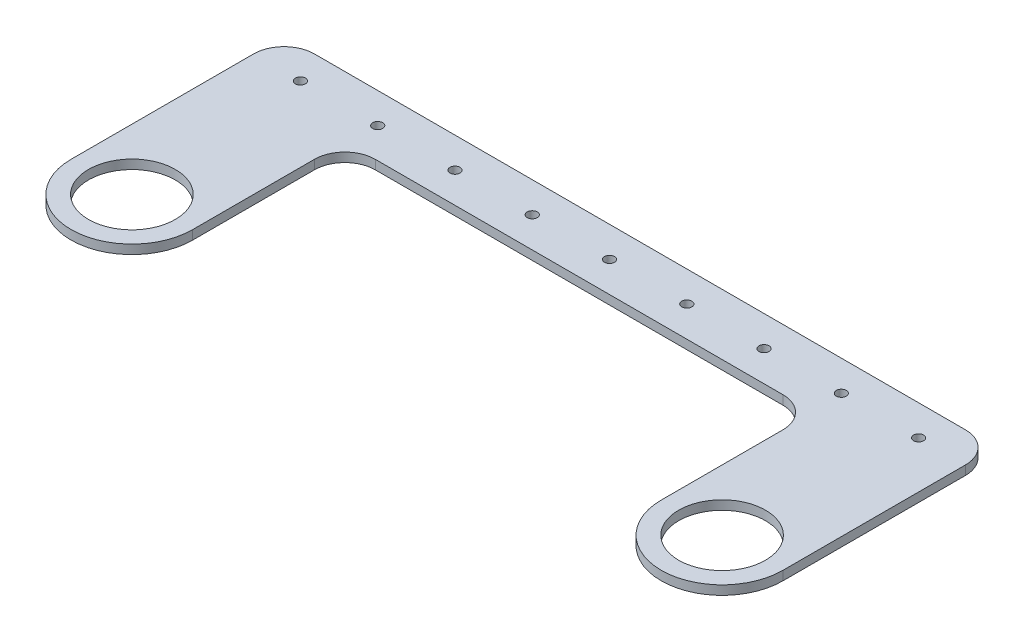
ISO-10303-21;
HEADER;
FILE_DESCRIPTION(('STEP AP214'),'2;1');
FILE_NAME('part.step','',(''),(''),'','','');
FILE_SCHEMA(('AUTOMOTIVE_DESIGN { 1 0 10303 214 1 1 1 1 }'));
ENDSEC;
DATA;
#1=APPLICATION_CONTEXT('core data for automotive mechanical design processes');
#2=APPLICATION_PROTOCOL_DEFINITION('international standard','automotive_design',2000,#1);
#3=PRODUCT_CONTEXT('',#1,'mechanical');
#4=PRODUCT('Part','Part','',(#3));
#5=PRODUCT_RELATED_PRODUCT_CATEGORY('part','',(#4));
#6=PRODUCT_DEFINITION_FORMATION('','',#4);
#7=PRODUCT_DEFINITION_CONTEXT('part definition',#1,'design');
#8=PRODUCT_DEFINITION('design','',#6,#7);
#9=PRODUCT_DEFINITION_SHAPE('','',#8);
#10=(LENGTH_UNIT() NAMED_UNIT(*) SI_UNIT(.MILLI.,.METRE.));
#11=(NAMED_UNIT(*) PLANE_ANGLE_UNIT() SI_UNIT($,.RADIAN.));
#12=(NAMED_UNIT(*) SI_UNIT($,.STERADIAN.) SOLID_ANGLE_UNIT());
#13=UNCERTAINTY_MEASURE_WITH_UNIT(LENGTH_MEASURE(1.E-05),#10,'distance_accuracy_value','');
#14=(GEOMETRIC_REPRESENTATION_CONTEXT(3) GLOBAL_UNCERTAINTY_ASSIGNED_CONTEXT((#13)) GLOBAL_UNIT_ASSIGNED_CONTEXT((#10,
#11,#12)) REPRESENTATION_CONTEXT('',''));
#15=CARTESIAN_POINT('',(0.,0.,0.));
#16=DIRECTION('',(0.,0.,1.));
#17=DIRECTION('',(1.,0.,0.));
#18=AXIS2_PLACEMENT_3D('',#15,#16,#17);
#19=CARTESIAN_POINT('',(0.,3.,10.));
#20=DIRECTION('',(0.,0.,-1.));
#21=DIRECTION('',(-1.,0.,0.));
#22=AXIS2_PLACEMENT_3D('',#19,#20,#21);
#23=PLANE('',#22);
#24=DIRECTION('',(1.,0.,0.));
#25=VECTOR('',#24,1.);
#26=CARTESIAN_POINT('',(0.,0.,10.));
#27=LINE('',#26,#25);
#28=CARTESIAN_POINT('',(-67.,0.,10.));
#29=VERTEX_POINT('',#28);
#30=CARTESIAN_POINT('',(67.,0.,10.));
#31=VERTEX_POINT('',#30);
#32=EDGE_CURVE('E208',#29,#31,#27,.T.);
#33=ORIENTED_EDGE('',*,*,#32,.T.);
#34=DIRECTION('',(0.,-1.,0.));
#35=VECTOR('',#34,1.);
#36=CARTESIAN_POINT('',(67.,3.,10.));
#37=LINE('',#36,#35);
#38=CARTESIAN_POINT('',(67.,3.,10.));
#39=VERTEX_POINT('',#38);
#40=EDGE_CURVE('E269',#31,#39,#37,.F.);
#41=ORIENTED_EDGE('',*,*,#40,.T.);
#42=DIRECTION('',(1.,0.,0.));
#43=VECTOR('',#42,1.);
#44=CARTESIAN_POINT('',(0.,3.,10.));
#45=LINE('',#44,#43);
#46=CARTESIAN_POINT('',(-67.,3.,10.));
#47=VERTEX_POINT('',#46);
#48=EDGE_CURVE('E145',#47,#39,#45,.T.);
#49=ORIENTED_EDGE('',*,*,#48,.F.);
#50=DIRECTION('',(0.,-1.,0.));
#51=VECTOR('',#50,1.);
#52=CARTESIAN_POINT('',(-67.,3.,10.));
#53=LINE('',#52,#51);
#54=EDGE_CURVE('E266',#47,#29,#53,.T.);
#55=ORIENTED_EDGE('',*,*,#54,.T.);
#56=EDGE_LOOP('',(#33,#41,#49,#55));
#57=FACE_BOUND('',#56,.T.);
#58=ADVANCED_FACE('F43',(#57),#23,.F.);
#59=CARTESIAN_POINT('',(77.,3.,0.));
#60=DIRECTION('',(1.,0.,0.));
#61=DIRECTION('',(0.,0.,-1.));
#62=AXIS2_PLACEMENT_3D('',#59,#60,#61);
#63=PLANE('',#62);
#64=DIRECTION('',(0.,0.,1.));
#65=VECTOR('',#64,1.);
#66=CARTESIAN_POINT('',(77.,3.,0.));
#67=LINE('',#66,#65);
#68=CARTESIAN_POINT('',(77.,3.,20.));
#69=VERTEX_POINT('',#68);
#70=CARTESIAN_POINT('',(77.,3.,60.));
#71=VERTEX_POINT('',#70);
#72=EDGE_CURVE('E133',#69,#71,#67,.T.);
#73=ORIENTED_EDGE('',*,*,#72,.F.);
#74=DIRECTION('',(0.,-1.,0.));
#75=VECTOR('',#74,1.);
#76=CARTESIAN_POINT('',(77.,0.,20.));
#77=LINE('',#76,#75);
#78=CARTESIAN_POINT('',(77.,0.,20.));
#79=VERTEX_POINT('',#78);
#80=EDGE_CURVE('E155',#69,#79,#77,.T.);
#81=ORIENTED_EDGE('',*,*,#80,.T.);
#82=DIRECTION('',(0.,0.,1.));
#83=VECTOR('',#82,1.);
#84=CARTESIAN_POINT('',(77.,0.,0.));
#85=LINE('',#84,#83);
#86=CARTESIAN_POINT('',(77.,0.,60.));
#87=VERTEX_POINT('',#86);
#88=EDGE_CURVE('E151',#79,#87,#85,.T.);
#89=ORIENTED_EDGE('',*,*,#88,.T.);
#90=DIRECTION('',(0.,-1.,0.));
#91=VECTOR('',#90,1.);
#92=CARTESIAN_POINT('',(77.,3.,60.));
#93=LINE('',#92,#91);
#94=EDGE_CURVE('E148',#71,#87,#93,.T.);
#95=ORIENTED_EDGE('',*,*,#94,.F.);
#96=EDGE_LOOP('',(#73,#81,#89,#95));
#97=FACE_BOUND('',#96,.T.);
#98=ADVANCED_FACE('F149',(#97),#63,.F.);
#99=CARTESIAN_POINT('',(97.,3.,60.));
#100=DIRECTION('',(0.,-1.,0.));
#101=DIRECTION('',(0.,0.,-1.));
#102=AXIS2_PLACEMENT_3D('',#99,#100,#101);
#103=CYLINDRICAL_SURFACE('',#102,20.);
#104=CARTESIAN_POINT('',(97.,0.,60.));
#105=DIRECTION('',(0.,1.,0.));
#106=DIRECTION('',(0.,0.,1.));
#107=AXIS2_PLACEMENT_3D('',#104,#105,#106);
#108=CIRCLE('',#107,20.);
#109=CARTESIAN_POINT('',(117.,0.,60.));
#110=VERTEX_POINT('',#109);
#111=EDGE_CURVE('E212',#110,#87,#108,.F.);
#112=ORIENTED_EDGE('',*,*,#111,.F.);
#113=DIRECTION('',(0.,-1.,0.));
#114=VECTOR('',#113,1.);
#115=CARTESIAN_POINT('',(117.,3.,60.));
#116=LINE('',#115,#114);
#117=CARTESIAN_POINT('',(117.,3.,60.));
#118=VERTEX_POINT('',#117);
#119=EDGE_CURVE('E156',#118,#110,#116,.T.);
#120=ORIENTED_EDGE('',*,*,#119,.F.);
#121=CARTESIAN_POINT('',(97.,3.,60.));
#122=DIRECTION('',(0.,1.,0.));
#123=DIRECTION('',(0.,0.,1.));
#124=AXIS2_PLACEMENT_3D('',#121,#122,#123);
#125=CIRCLE('',#124,20.);
#126=EDGE_CURVE('E138',#118,#71,#125,.F.);
#127=ORIENTED_EDGE('',*,*,#126,.T.);
#128=ORIENTED_EDGE('',*,*,#94,.T.);
#129=EDGE_LOOP('',(#112,#120,#127,#128));
#130=FACE_BOUND('',#129,.T.);
#131=ADVANCED_FACE('F158',(#130),#103,.T.);
#132=CARTESIAN_POINT('',(117.,3.,0.));
#133=DIRECTION('',(-1.,0.,0.));
#134=DIRECTION('',(0.,0.,1.));
#135=AXIS2_PLACEMENT_3D('',#132,#133,#134);
#136=PLANE('',#135);
#137=DIRECTION('',(0.,0.,-1.));
#138=VECTOR('',#137,1.);
#139=CARTESIAN_POINT('',(117.,0.,0.));
#140=LINE('',#139,#138);
#141=CARTESIAN_POINT('',(117.,0.,0.));
#142=VERTEX_POINT('',#141);
#143=EDGE_CURVE('E214',#110,#142,#140,.T.);
#144=ORIENTED_EDGE('',*,*,#143,.T.);
#145=DIRECTION('',(0.,-1.,0.));
#146=VECTOR('',#145,1.);
#147=CARTESIAN_POINT('',(117.,3.,0.));
#148=LINE('',#147,#146);
#149=CARTESIAN_POINT('',(117.,3.,0.));
#150=VERTEX_POINT('',#149);
#151=EDGE_CURVE('E66',#142,#150,#148,.F.);
#152=ORIENTED_EDGE('',*,*,#151,.T.);
#153=DIRECTION('',(0.,0.,-1.));
#154=VECTOR('',#153,1.);
#155=CARTESIAN_POINT('',(117.,3.,0.));
#156=LINE('',#155,#154);
#157=EDGE_CURVE('E159',#118,#150,#156,.T.);
#158=ORIENTED_EDGE('',*,*,#157,.F.);
#159=ORIENTED_EDGE('',*,*,#119,.T.);
#160=EDGE_LOOP('',(#144,#152,#158,#159));
#161=FACE_BOUND('',#160,.T.);
#162=ADVANCED_FACE('F312',(#161),#136,.F.);
#163=CARTESIAN_POINT('',(0.,3.,-10.));
#164=DIRECTION('',(0.,0.,-1.));
#165=DIRECTION('',(-1.,0.,0.));
#166=AXIS2_PLACEMENT_3D('',#163,#164,#165);
#167=PLANE('',#166);
#168=DIRECTION('',(1.,0.,0.));
#169=VECTOR('',#168,1.);
#170=CARTESIAN_POINT('',(0.,3.,-10.));
#171=LINE('',#170,#169);
#172=CARTESIAN_POINT('',(-107.,3.,-10.));
#173=VERTEX_POINT('',#172);
#174=CARTESIAN_POINT('',(107.,3.,-10.));
#175=VERTEX_POINT('',#174);
#176=EDGE_CURVE('E161',#173,#175,#171,.T.);
#177=ORIENTED_EDGE('',*,*,#176,.T.);
#178=DIRECTION('',(0.,-1.,0.));
#179=VECTOR('',#178,1.);
#180=CARTESIAN_POINT('',(107.,0.,-10.));
#181=LINE('',#180,#179);
#182=CARTESIAN_POINT('',(107.,0.,-10.));
#183=VERTEX_POINT('',#182);
#184=EDGE_CURVE('E275',#175,#183,#181,.T.);
#185=ORIENTED_EDGE('',*,*,#184,.T.);
#186=DIRECTION('',(1.,0.,0.));
#187=VECTOR('',#186,1.);
#188=CARTESIAN_POINT('',(0.,0.,-10.));
#189=LINE('',#188,#187);
#190=CARTESIAN_POINT('',(-107.,0.,-10.));
#191=VERTEX_POINT('',#190);
#192=EDGE_CURVE('E216',#191,#183,#189,.T.);
#193=ORIENTED_EDGE('',*,*,#192,.F.);
#194=DIRECTION('',(0.,-1.,0.));
#195=VECTOR('',#194,1.);
#196=CARTESIAN_POINT('',(-107.,3.,-10.));
#197=LINE('',#196,#195);
#198=EDGE_CURVE('E273',#191,#173,#197,.F.);
#199=ORIENTED_EDGE('',*,*,#198,.T.);
#200=EDGE_LOOP('',(#177,#185,#193,#199));
#201=FACE_BOUND('',#200,.T.);
#202=ADVANCED_FACE('F318',(#201),#167,.T.);
#203=CARTESIAN_POINT('',(-117.,3.,0.));
#204=DIRECTION('',(1.,0.,0.));
#205=DIRECTION('',(0.,0.,-1.));
#206=AXIS2_PLACEMENT_3D('',#203,#204,#205);
#207=PLANE('',#206);
#208=DIRECTION('',(0.,0.,1.));
#209=VECTOR('',#208,1.);
#210=CARTESIAN_POINT('',(-117.,3.,0.));
#211=LINE('',#210,#209);
#212=CARTESIAN_POINT('',(-117.,3.,0.));
#213=VERTEX_POINT('',#212);
#214=CARTESIAN_POINT('',(-117.,3.,60.));
#215=VERTEX_POINT('',#214);
#216=EDGE_CURVE('E167',#213,#215,#211,.T.);
#217=ORIENTED_EDGE('',*,*,#216,.F.);
#218=DIRECTION('',(0.,-1.,0.));
#219=VECTOR('',#218,1.);
#220=CARTESIAN_POINT('',(-117.,0.,0.));
#221=LINE('',#220,#219);
#222=CARTESIAN_POINT('',(-117.,0.,0.));
#223=VERTEX_POINT('',#222);
#224=EDGE_CURVE('E286',#213,#223,#221,.T.);
#225=ORIENTED_EDGE('',*,*,#224,.T.);
#226=DIRECTION('',(0.,0.,1.));
#227=VECTOR('',#226,1.);
#228=CARTESIAN_POINT('',(-117.,0.,0.));
#229=LINE('',#228,#227);
#230=CARTESIAN_POINT('',(-117.,0.,60.));
#231=VERTEX_POINT('',#230);
#232=EDGE_CURVE('E219',#223,#231,#229,.T.);
#233=ORIENTED_EDGE('',*,*,#232,.T.);
#234=DIRECTION('',(0.,-1.,0.));
#235=VECTOR('',#234,1.);
#236=CARTESIAN_POINT('',(-117.,3.,60.));
#237=LINE('',#236,#235);
#238=EDGE_CURVE('E261',#215,#231,#237,.T.);
#239=ORIENTED_EDGE('',*,*,#238,.F.);
#240=EDGE_LOOP('',(#217,#225,#233,#239));
#241=FACE_BOUND('',#240,.T.);
#242=ADVANCED_FACE('F325',(#241),#207,.F.);
#243=CARTESIAN_POINT('',(-97.,3.,60.));
#244=DIRECTION('',(0.,-1.,0.));
#245=DIRECTION('',(0.,0.,-1.));
#246=AXIS2_PLACEMENT_3D('',#243,#244,#245);
#247=CYLINDRICAL_SURFACE('',#246,20.);
#248=CARTESIAN_POINT('',(-97.,0.,60.));
#249=DIRECTION('',(0.,1.,0.));
#250=DIRECTION('',(0.,0.,1.));
#251=AXIS2_PLACEMENT_3D('',#248,#249,#250);
#252=CIRCLE('',#251,20.);
#253=CARTESIAN_POINT('',(-77.,0.,60.));
#254=VERTEX_POINT('',#253);
#255=EDGE_CURVE('E221',#231,#254,#252,.T.);
#256=ORIENTED_EDGE('',*,*,#255,.T.);
#257=DIRECTION('',(0.,-1.,0.));
#258=VECTOR('',#257,1.);
#259=CARTESIAN_POINT('',(-77.,3.,60.));
#260=LINE('',#259,#258);
#261=CARTESIAN_POINT('',(-77.,3.,60.));
#262=VERTEX_POINT('',#261);
#263=EDGE_CURVE('E207',#262,#254,#260,.T.);
#264=ORIENTED_EDGE('',*,*,#263,.F.);
#265=CARTESIAN_POINT('',(-97.,3.,60.));
#266=DIRECTION('',(0.,1.,0.));
#267=DIRECTION('',(0.,0.,1.));
#268=AXIS2_PLACEMENT_3D('',#265,#266,#267);
#269=CIRCLE('',#268,20.);
#270=EDGE_CURVE('E169',#215,#262,#269,.T.);
#271=ORIENTED_EDGE('',*,*,#270,.F.);
#272=ORIENTED_EDGE('',*,*,#238,.T.);
#273=EDGE_LOOP('',(#256,#264,#271,#272));
#274=FACE_BOUND('',#273,.T.);
#275=ADVANCED_FACE('F328',(#274),#247,.T.);
#276=CARTESIAN_POINT('',(101.6,3.,0.));
#277=DIRECTION('',(0.,-1.,0.));
#278=DIRECTION('',(0.,0.,-1.));
#279=AXIS2_PLACEMENT_3D('',#276,#277,#278);
#280=CYLINDRICAL_SURFACE('',#279,1.65);
#281=CARTESIAN_POINT('',(101.6,3.,0.));
#282=DIRECTION('',(0.,1.,0.));
#283=DIRECTION('',(0.,0.,1.));
#284=AXIS2_PLACEMENT_3D('',#281,#282,#283);
#285=CIRCLE('',#284,1.65);
#286=CARTESIAN_POINT('',(101.6,3.,1.65));
#287=VERTEX_POINT('',#286);
#288=EDGE_CURVE('E201',#287,#287,#285,.T.);
#289=ORIENTED_EDGE('',*,*,#288,.T.);
#290=EDGE_LOOP('',(#289));
#291=FACE_BOUND('',#290,.T.);
#292=CARTESIAN_POINT('',(101.6,0.,0.));
#293=DIRECTION('',(0.,1.,0.));
#294=DIRECTION('',(0.,0.,1.));
#295=AXIS2_PLACEMENT_3D('',#292,#293,#294);
#296=CIRCLE('',#295,1.65);
#297=CARTESIAN_POINT('',(101.6,0.,1.65));
#298=VERTEX_POINT('',#297);
#299=EDGE_CURVE('E253',#298,#298,#296,.T.);
#300=ORIENTED_EDGE('',*,*,#299,.F.);
#301=EDGE_LOOP('',(#300));
#302=FACE_BOUND('',#301,.T.);
#303=ADVANCED_FACE('F331',(#291,#302),#280,.F.);
#304=CARTESIAN_POINT('',(0.,3.,0.));
#305=DIRECTION('',(0.,-1.,0.));
#306=DIRECTION('',(0.,0.,-1.));
#307=AXIS2_PLACEMENT_3D('',#304,#305,#306);
#308=CYLINDRICAL_SURFACE('',#307,1.65);
#309=CARTESIAN_POINT('',(0.,3.,0.));
#310=DIRECTION('',(0.,1.,0.));
#311=DIRECTION('',(0.,0.,1.));
#312=AXIS2_PLACEMENT_3D('',#309,#310,#311);
#313=CIRCLE('',#312,1.65);
#314=CARTESIAN_POINT('',(0.,3.,1.65));
#315=VERTEX_POINT('',#314);
#316=EDGE_CURVE('E198',#315,#315,#313,.T.);
#317=ORIENTED_EDGE('',*,*,#316,.T.);
#318=EDGE_LOOP('',(#317));
#319=FACE_BOUND('',#318,.T.);
#320=CARTESIAN_POINT('',(0.,0.,0.));
#321=DIRECTION('',(0.,1.,0.));
#322=DIRECTION('',(0.,0.,1.));
#323=AXIS2_PLACEMENT_3D('',#320,#321,#322);
#324=CIRCLE('',#323,1.65);
#325=CARTESIAN_POINT('',(0.,0.,1.65));
#326=VERTEX_POINT('',#325);
#327=EDGE_CURVE('E250',#326,#326,#324,.T.);
#328=ORIENTED_EDGE('',*,*,#327,.F.);
#329=EDGE_LOOP('',(#328));
#330=FACE_BOUND('',#329,.T.);
#331=ADVANCED_FACE('F337',(#319,#330),#308,.F.);
#332=CARTESIAN_POINT('',(25.4,3.,0.));
#333=DIRECTION('',(0.,-1.,0.));
#334=DIRECTION('',(0.,0.,-1.));
#335=AXIS2_PLACEMENT_3D('',#332,#333,#334);
#336=CYLINDRICAL_SURFACE('',#335,1.65);
#337=CARTESIAN_POINT('',(25.4,3.,0.));
#338=DIRECTION('',(0.,1.,0.));
#339=DIRECTION('',(0.,0.,1.));
#340=AXIS2_PLACEMENT_3D('',#337,#338,#339);
#341=CIRCLE('',#340,1.65);
#342=CARTESIAN_POINT('',(25.4,3.,1.65));
#343=VERTEX_POINT('',#342);
#344=EDGE_CURVE('E195',#343,#343,#341,.T.);
#345=ORIENTED_EDGE('',*,*,#344,.T.);
#346=EDGE_LOOP('',(#345));
#347=FACE_BOUND('',#346,.T.);
#348=CARTESIAN_POINT('',(25.4,0.,0.));
#349=DIRECTION('',(0.,1.,0.));
#350=DIRECTION('',(0.,0.,1.));
#351=AXIS2_PLACEMENT_3D('',#348,#349,#350);
#352=CIRCLE('',#351,1.65);
#353=CARTESIAN_POINT('',(25.4,0.,1.65));
#354=VERTEX_POINT('',#353);
#355=EDGE_CURVE('E247',#354,#354,#352,.T.);
#356=ORIENTED_EDGE('',*,*,#355,.F.);
#357=EDGE_LOOP('',(#356));
#358=FACE_BOUND('',#357,.T.);
#359=ADVANCED_FACE('F470',(#347,#358),#336,.F.);
#360=CARTESIAN_POINT('',(50.8,3.,0.));
#361=DIRECTION('',(0.,-1.,0.));
#362=DIRECTION('',(0.,0.,-1.));
#363=AXIS2_PLACEMENT_3D('',#360,#361,#362);
#364=CYLINDRICAL_SURFACE('',#363,1.65);
#365=CARTESIAN_POINT('',(50.8,3.,0.));
#366=DIRECTION('',(0.,1.,0.));
#367=DIRECTION('',(0.,0.,1.));
#368=AXIS2_PLACEMENT_3D('',#365,#366,#367);
#369=CIRCLE('',#368,1.65);
#370=CARTESIAN_POINT('',(50.8,3.,1.65));
#371=VERTEX_POINT('',#370);
#372=EDGE_CURVE('E192',#371,#371,#369,.T.);
#373=ORIENTED_EDGE('',*,*,#372,.T.);
#374=EDGE_LOOP('',(#373));
#375=FACE_BOUND('',#374,.T.);
#376=CARTESIAN_POINT('',(50.8,0.,0.));
#377=DIRECTION('',(0.,1.,0.));
#378=DIRECTION('',(0.,0.,1.));
#379=AXIS2_PLACEMENT_3D('',#376,#377,#378);
#380=CIRCLE('',#379,1.65);
#381=CARTESIAN_POINT('',(50.8,0.,1.65));
#382=VERTEX_POINT('',#381);
#383=EDGE_CURVE('E244',#382,#382,#380,.T.);
#384=ORIENTED_EDGE('',*,*,#383,.F.);
#385=EDGE_LOOP('',(#384));
#386=FACE_BOUND('',#385,.T.);
#387=ADVANCED_FACE('F479',(#375,#386),#364,.F.);
#388=CARTESIAN_POINT('',(-25.4,3.,0.));
#389=DIRECTION('',(0.,-1.,0.));
#390=DIRECTION('',(0.,0.,-1.));
#391=AXIS2_PLACEMENT_3D('',#388,#389,#390);
#392=CYLINDRICAL_SURFACE('',#391,1.65);
#393=CARTESIAN_POINT('',(-25.4,3.,0.));
#394=DIRECTION('',(0.,1.,0.));
#395=DIRECTION('',(0.,0.,1.));
#396=AXIS2_PLACEMENT_3D('',#393,#394,#395);
#397=CIRCLE('',#396,1.65);
#398=CARTESIAN_POINT('',(-25.4,3.,1.65));
#399=VERTEX_POINT('',#398);
#400=EDGE_CURVE('E189',#399,#399,#397,.T.);
#401=ORIENTED_EDGE('',*,*,#400,.T.);
#402=EDGE_LOOP('',(#401));
#403=FACE_BOUND('',#402,.T.);
#404=CARTESIAN_POINT('',(-25.4,0.,0.));
#405=DIRECTION('',(0.,1.,0.));
#406=DIRECTION('',(0.,0.,1.));
#407=AXIS2_PLACEMENT_3D('',#404,#405,#406);
#408=CIRCLE('',#407,1.65);
#409=CARTESIAN_POINT('',(-25.4,0.,1.65));
#410=VERTEX_POINT('',#409);
#411=EDGE_CURVE('E241',#410,#410,#408,.T.);
#412=ORIENTED_EDGE('',*,*,#411,.F.);
#413=EDGE_LOOP('',(#412));
#414=FACE_BOUND('',#413,.T.);
#415=ADVANCED_FACE('F488',(#403,#414),#392,.F.);
#416=CARTESIAN_POINT('',(-50.8,3.,0.));
#417=DIRECTION('',(0.,-1.,0.));
#418=DIRECTION('',(0.,0.,-1.));
#419=AXIS2_PLACEMENT_3D('',#416,#417,#418);
#420=CYLINDRICAL_SURFACE('',#419,1.65);
#421=CARTESIAN_POINT('',(-50.8,3.,0.));
#422=DIRECTION('',(0.,1.,0.));
#423=DIRECTION('',(0.,0.,1.));
#424=AXIS2_PLACEMENT_3D('',#421,#422,#423);
#425=CIRCLE('',#424,1.65);
#426=CARTESIAN_POINT('',(-50.8,3.,1.65));
#427=VERTEX_POINT('',#426);
#428=EDGE_CURVE('E186',#427,#427,#425,.T.);
#429=ORIENTED_EDGE('',*,*,#428,.T.);
#430=EDGE_LOOP('',(#429));
#431=FACE_BOUND('',#430,.T.);
#432=CARTESIAN_POINT('',(-50.8,0.,0.));
#433=DIRECTION('',(0.,1.,0.));
#434=DIRECTION('',(0.,0.,1.));
#435=AXIS2_PLACEMENT_3D('',#432,#433,#434);
#436=CIRCLE('',#435,1.65);
#437=CARTESIAN_POINT('',(-50.8,0.,1.65));
#438=VERTEX_POINT('',#437);
#439=EDGE_CURVE('E238',#438,#438,#436,.T.);
#440=ORIENTED_EDGE('',*,*,#439,.F.);
#441=EDGE_LOOP('',(#440));
#442=FACE_BOUND('',#441,.T.);
#443=ADVANCED_FACE('F497',(#431,#442),#420,.F.);
#444=CARTESIAN_POINT('',(-97.,3.,60.));
#445=DIRECTION('',(0.,-1.,0.));
#446=DIRECTION('',(0.,0.,-1.));
#447=AXIS2_PLACEMENT_3D('',#444,#445,#446);
#448=CYLINDRICAL_SURFACE('',#447,14.26);
#449=CARTESIAN_POINT('',(-97.,3.,60.));
#450=DIRECTION('',(0.,1.,0.));
#451=DIRECTION('',(0.,0.,1.));
#452=AXIS2_PLACEMENT_3D('',#449,#450,#451);
#453=CIRCLE('',#452,14.26);
#454=CARTESIAN_POINT('',(-97.,3.,74.26));
#455=VERTEX_POINT('',#454);
#456=EDGE_CURVE('E183',#455,#455,#453,.T.);
#457=ORIENTED_EDGE('',*,*,#456,.T.);
#458=EDGE_LOOP('',(#457));
#459=FACE_BOUND('',#458,.T.);
#460=CARTESIAN_POINT('',(-97.,0.,60.));
#461=DIRECTION('',(0.,1.,0.));
#462=DIRECTION('',(0.,0.,1.));
#463=AXIS2_PLACEMENT_3D('',#460,#461,#462);
#464=CIRCLE('',#463,14.26);
#465=CARTESIAN_POINT('',(-97.,0.,74.26));
#466=VERTEX_POINT('',#465);
#467=EDGE_CURVE('E235',#466,#466,#464,.T.);
#468=ORIENTED_EDGE('',*,*,#467,.F.);
#469=EDGE_LOOP('',(#468));
#470=FACE_BOUND('',#469,.T.);
#471=ADVANCED_FACE('F506',(#459,#470),#448,.F.);
#472=CARTESIAN_POINT('',(-101.6,3.,0.));
#473=DIRECTION('',(0.,-1.,0.));
#474=DIRECTION('',(0.,0.,-1.));
#475=AXIS2_PLACEMENT_3D('',#472,#473,#474);
#476=CYLINDRICAL_SURFACE('',#475,1.65);
#477=CARTESIAN_POINT('',(-101.6,3.,0.));
#478=DIRECTION('',(0.,1.,0.));
#479=DIRECTION('',(0.,0.,1.));
#480=AXIS2_PLACEMENT_3D('',#477,#478,#479);
#481=CIRCLE('',#480,1.65);
#482=CARTESIAN_POINT('',(-101.6,3.,1.65));
#483=VERTEX_POINT('',#482);
#484=EDGE_CURVE('E180',#483,#483,#481,.T.);
#485=ORIENTED_EDGE('',*,*,#484,.T.);
#486=EDGE_LOOP('',(#485));
#487=FACE_BOUND('',#486,.T.);
#488=CARTESIAN_POINT('',(-101.6,0.,0.));
#489=DIRECTION('',(0.,1.,0.));
#490=DIRECTION('',(0.,0.,1.));
#491=AXIS2_PLACEMENT_3D('',#488,#489,#490);
#492=CIRCLE('',#491,1.65);
#493=CARTESIAN_POINT('',(-101.6,0.,1.65));
#494=VERTEX_POINT('',#493);
#495=EDGE_CURVE('E232',#494,#494,#492,.T.);
#496=ORIENTED_EDGE('',*,*,#495,.F.);
#497=EDGE_LOOP('',(#496));
#498=FACE_BOUND('',#497,.T.);
#499=ADVANCED_FACE('F515',(#487,#498),#476,.F.);
#500=CARTESIAN_POINT('',(76.2,3.,0.));
#501=DIRECTION('',(0.,-1.,0.));
#502=DIRECTION('',(0.,0.,-1.));
#503=AXIS2_PLACEMENT_3D('',#500,#501,#502);
#504=CYLINDRICAL_SURFACE('',#503,1.65);
#505=CARTESIAN_POINT('',(76.2,3.,0.));
#506=DIRECTION('',(0.,1.,0.));
#507=DIRECTION('',(0.,0.,1.));
#508=AXIS2_PLACEMENT_3D('',#505,#506,#507);
#509=CIRCLE('',#508,1.65);
#510=CARTESIAN_POINT('',(76.2,3.,1.65));
#511=VERTEX_POINT('',#510);
#512=EDGE_CURVE('E177',#511,#511,#509,.T.);
#513=ORIENTED_EDGE('',*,*,#512,.T.);
#514=EDGE_LOOP('',(#513));
#515=FACE_BOUND('',#514,.T.);
#516=CARTESIAN_POINT('',(76.2,0.,0.));
#517=DIRECTION('',(0.,1.,0.));
#518=DIRECTION('',(0.,0.,1.));
#519=AXIS2_PLACEMENT_3D('',#516,#517,#518);
#520=CIRCLE('',#519,1.65);
#521=CARTESIAN_POINT('',(76.2,0.,1.65));
#522=VERTEX_POINT('',#521);
#523=EDGE_CURVE('E229',#522,#522,#520,.T.);
#524=ORIENTED_EDGE('',*,*,#523,.F.);
#525=EDGE_LOOP('',(#524));
#526=FACE_BOUND('',#525,.T.);
#527=ADVANCED_FACE('F524',(#515,#526),#504,.F.);
#528=CARTESIAN_POINT('',(-76.2,3.,0.));
#529=DIRECTION('',(0.,-1.,0.));
#530=DIRECTION('',(0.,0.,-1.));
#531=AXIS2_PLACEMENT_3D('',#528,#529,#530);
#532=CYLINDRICAL_SURFACE('',#531,1.65);
#533=CARTESIAN_POINT('',(-76.2,3.,0.));
#534=DIRECTION('',(0.,1.,0.));
#535=DIRECTION('',(0.,0.,1.));
#536=AXIS2_PLACEMENT_3D('',#533,#534,#535);
#537=CIRCLE('',#536,1.65);
#538=CARTESIAN_POINT('',(-76.2,3.,1.65));
#539=VERTEX_POINT('',#538);
#540=EDGE_CURVE('E174',#539,#539,#537,.T.);
#541=ORIENTED_EDGE('',*,*,#540,.T.);
#542=EDGE_LOOP('',(#541));
#543=FACE_BOUND('',#542,.T.);
#544=CARTESIAN_POINT('',(-76.2,0.,0.));
#545=DIRECTION('',(0.,1.,0.));
#546=DIRECTION('',(0.,0.,1.));
#547=AXIS2_PLACEMENT_3D('',#544,#545,#546);
#548=CIRCLE('',#547,1.65);
#549=CARTESIAN_POINT('',(-76.2,0.,1.65));
#550=VERTEX_POINT('',#549);
#551=EDGE_CURVE('E226',#550,#550,#548,.T.);
#552=ORIENTED_EDGE('',*,*,#551,.F.);
#553=EDGE_LOOP('',(#552));
#554=FACE_BOUND('',#553,.T.);
#555=ADVANCED_FACE('F404',(#543,#554),#532,.F.);
#556=CARTESIAN_POINT('',(-77.,3.,0.));
#557=DIRECTION('',(1.,0.,0.));
#558=DIRECTION('',(0.,0.,-1.));
#559=AXIS2_PLACEMENT_3D('',#556,#557,#558);
#560=PLANE('',#559);
#561=DIRECTION('',(0.,0.,1.));
#562=VECTOR('',#561,1.);
#563=CARTESIAN_POINT('',(-77.,0.,0.));
#564=LINE('',#563,#562);
#565=CARTESIAN_POINT('',(-77.,0.,20.));
#566=VERTEX_POINT('',#565);
#567=EDGE_CURVE('E224',#566,#254,#564,.T.);
#568=ORIENTED_EDGE('',*,*,#567,.F.);
#569=DIRECTION('',(0.,-1.,0.));
#570=VECTOR('',#569,1.);
#571=CARTESIAN_POINT('',(-77.,3.,20.));
#572=LINE('',#571,#570);
#573=CARTESIAN_POINT('',(-77.,3.,20.));
#574=VERTEX_POINT('',#573);
#575=EDGE_CURVE('E271',#566,#574,#572,.F.);
#576=ORIENTED_EDGE('',*,*,#575,.T.);
#577=DIRECTION('',(0.,0.,1.));
#578=VECTOR('',#577,1.);
#579=CARTESIAN_POINT('',(-77.,3.,0.));
#580=LINE('',#579,#578);
#581=EDGE_CURVE('E172',#574,#262,#580,.T.);
#582=ORIENTED_EDGE('',*,*,#581,.T.);
#583=ORIENTED_EDGE('',*,*,#263,.T.);
#584=EDGE_LOOP('',(#568,#576,#582,#583));
#585=FACE_BOUND('',#584,.T.);
#586=ADVANCED_FACE('F301',(#585),#560,.T.);
#587=CARTESIAN_POINT('',(97.,3.,60.));
#588=DIRECTION('',(0.,-1.,0.));
#589=DIRECTION('',(0.,0.,-1.));
#590=AXIS2_PLACEMENT_3D('',#587,#588,#589);
#591=CYLINDRICAL_SURFACE('',#590,14.26);
#592=CARTESIAN_POINT('',(97.,3.,60.));
#593=DIRECTION('',(0.,1.,0.));
#594=DIRECTION('',(0.,0.,1.));
#595=AXIS2_PLACEMENT_3D('',#592,#593,#594);
#596=CIRCLE('',#595,14.26);
#597=CARTESIAN_POINT('',(97.,3.,74.26));
#598=VERTEX_POINT('',#597);
#599=EDGE_CURVE('E204',#598,#598,#596,.F.);
#600=ORIENTED_EDGE('',*,*,#599,.F.);
#601=EDGE_LOOP('',(#600));
#602=FACE_BOUND('',#601,.T.);
#603=CARTESIAN_POINT('',(97.,0.,60.));
#604=DIRECTION('',(0.,1.,0.));
#605=DIRECTION('',(0.,0.,1.));
#606=AXIS2_PLACEMENT_3D('',#603,#604,#605);
#607=CIRCLE('',#606,14.26);
#608=CARTESIAN_POINT('',(97.,0.,74.26));
#609=VERTEX_POINT('',#608);
#610=EDGE_CURVE('E256',#609,#609,#607,.F.);
#611=ORIENTED_EDGE('',*,*,#610,.T.);
#612=EDGE_LOOP('',(#611));
#613=FACE_BOUND('',#612,.T.);
#614=ADVANCED_FACE('F396',(#602,#613),#591,.F.);
#615=CARTESIAN_POINT('',(0.,3.,0.));
#616=DIRECTION('',(0.,1.,0.));
#617=DIRECTION('',(0.,0.,1.));
#618=AXIS2_PLACEMENT_3D('',#615,#616,#617);
#619=PLANE('',#618);
#620=ORIENTED_EDGE('',*,*,#157,.T.);
#621=CARTESIAN_POINT('',(107.,3.,0.));
#622=DIRECTION('',(0.,1.,0.));
#623=DIRECTION('',(0.,0.,1.));
#624=AXIS2_PLACEMENT_3D('',#621,#622,#623);
#625=CIRCLE('',#624,10.);
#626=EDGE_CURVE('E284',#150,#175,#625,.T.);
#627=ORIENTED_EDGE('',*,*,#626,.T.);
#628=ORIENTED_EDGE('',*,*,#176,.F.);
#629=CARTESIAN_POINT('',(-107.,3.,0.));
#630=DIRECTION('',(0.,1.,0.));
#631=DIRECTION('',(0.,0.,1.));
#632=AXIS2_PLACEMENT_3D('',#629,#630,#631);
#633=CIRCLE('',#632,10.);
#634=EDGE_CURVE('E58',#173,#213,#633,.T.);
#635=ORIENTED_EDGE('',*,*,#634,.T.);
#636=ORIENTED_EDGE('',*,*,#216,.T.);
#637=ORIENTED_EDGE('',*,*,#270,.T.);
#638=ORIENTED_EDGE('',*,*,#581,.F.);
#639=CARTESIAN_POINT('',(-67.,3.,20.));
#640=DIRECTION('',(0.,1.,0.));
#641=DIRECTION('',(0.,0.,1.));
#642=AXIS2_PLACEMENT_3D('',#639,#640,#641);
#643=CIRCLE('',#642,10.);
#644=EDGE_CURVE('E11',#574,#47,#643,.F.);
#645=ORIENTED_EDGE('',*,*,#644,.T.);
#646=ORIENTED_EDGE('',*,*,#48,.T.);
#647=CARTESIAN_POINT('',(67.,3.,20.));
#648=DIRECTION('',(0.,1.,0.));
#649=DIRECTION('',(0.,0.,1.));
#650=AXIS2_PLACEMENT_3D('',#647,#648,#649);
#651=CIRCLE('',#650,10.);
#652=EDGE_CURVE('E141',#39,#69,#651,.F.);
#653=ORIENTED_EDGE('',*,*,#652,.T.);
#654=ORIENTED_EDGE('',*,*,#72,.T.);
#655=ORIENTED_EDGE('',*,*,#126,.F.);
#656=EDGE_LOOP('',(#620,#627,#628,#635,#636,#637,#638,#645,#646,#653,#654,#655));
#657=FACE_BOUND('',#656,.T.);
#658=ORIENTED_EDGE('',*,*,#540,.F.);
#659=EDGE_LOOP('',(#658));
#660=FACE_BOUND('',#659,.T.);
#661=ORIENTED_EDGE('',*,*,#512,.F.);
#662=EDGE_LOOP('',(#661));
#663=FACE_BOUND('',#662,.T.);
#664=ORIENTED_EDGE('',*,*,#484,.F.);
#665=EDGE_LOOP('',(#664));
#666=FACE_BOUND('',#665,.T.);
#667=ORIENTED_EDGE('',*,*,#456,.F.);
#668=EDGE_LOOP('',(#667));
#669=FACE_BOUND('',#668,.T.);
#670=ORIENTED_EDGE('',*,*,#428,.F.);
#671=EDGE_LOOP('',(#670));
#672=FACE_BOUND('',#671,.T.);
#673=ORIENTED_EDGE('',*,*,#400,.F.);
#674=EDGE_LOOP('',(#673));
#675=FACE_BOUND('',#674,.T.);
#676=ORIENTED_EDGE('',*,*,#372,.F.);
#677=EDGE_LOOP('',(#676));
#678=FACE_BOUND('',#677,.T.);
#679=ORIENTED_EDGE('',*,*,#344,.F.);
#680=EDGE_LOOP('',(#679));
#681=FACE_BOUND('',#680,.T.);
#682=ORIENTED_EDGE('',*,*,#316,.F.);
#683=EDGE_LOOP('',(#682));
#684=FACE_BOUND('',#683,.T.);
#685=ORIENTED_EDGE('',*,*,#288,.F.);
#686=EDGE_LOOP('',(#685));
#687=FACE_BOUND('',#686,.T.);
#688=ORIENTED_EDGE('',*,*,#599,.T.);
#689=EDGE_LOOP('',(#688));
#690=FACE_BOUND('',#689,.T.);
#691=ADVANCED_FACE('F135',(#657,#660,#663,#666,#669,#672,#675,#678,#681,#684,#687,#690),#619,.T.);
#692=CARTESIAN_POINT('',(0.,0.,0.));
#693=DIRECTION('',(0.,1.,0.));
#694=DIRECTION('',(0.,0.,1.));
#695=AXIS2_PLACEMENT_3D('',#692,#693,#694);
#696=PLANE('',#695);
#697=ORIENTED_EDGE('',*,*,#192,.T.);
#698=CARTESIAN_POINT('',(107.,0.,0.));
#699=DIRECTION('',(0.,1.,0.));
#700=DIRECTION('',(0.,0.,1.));
#701=AXIS2_PLACEMENT_3D('',#698,#699,#700);
#702=CIRCLE('',#701,10.);
#703=EDGE_CURVE('E280',#183,#142,#702,.F.);
#704=ORIENTED_EDGE('',*,*,#703,.T.);
#705=ORIENTED_EDGE('',*,*,#143,.F.);
#706=ORIENTED_EDGE('',*,*,#111,.T.);
#707=ORIENTED_EDGE('',*,*,#88,.F.);
#708=CARTESIAN_POINT('',(67.,0.,20.));
#709=DIRECTION('',(0.,1.,0.));
#710=DIRECTION('',(0.,0.,1.));
#711=AXIS2_PLACEMENT_3D('',#708,#709,#710);
#712=CIRCLE('',#711,10.);
#713=EDGE_CURVE('E289',#79,#31,#712,.T.);
#714=ORIENTED_EDGE('',*,*,#713,.T.);
#715=ORIENTED_EDGE('',*,*,#32,.F.);
#716=CARTESIAN_POINT('',(-67.,0.,20.));
#717=DIRECTION('',(0.,1.,0.));
#718=DIRECTION('',(0.,0.,1.));
#719=AXIS2_PLACEMENT_3D('',#716,#717,#718);
#720=CIRCLE('',#719,10.);
#721=EDGE_CURVE('E51',#29,#566,#720,.T.);
#722=ORIENTED_EDGE('',*,*,#721,.T.);
#723=ORIENTED_EDGE('',*,*,#567,.T.);
#724=ORIENTED_EDGE('',*,*,#255,.F.);
#725=ORIENTED_EDGE('',*,*,#232,.F.);
#726=CARTESIAN_POINT('',(-107.,0.,0.));
#727=DIRECTION('',(0.,1.,0.));
#728=DIRECTION('',(0.,0.,1.));
#729=AXIS2_PLACEMENT_3D('',#726,#727,#728);
#730=CIRCLE('',#729,10.);
#731=EDGE_CURVE('E278',#223,#191,#730,.F.);
#732=ORIENTED_EDGE('',*,*,#731,.T.);
#733=EDGE_LOOP('',(#697,#704,#705,#706,#707,#714,#715,#722,#723,#724,#725,#732));
#734=FACE_BOUND('',#733,.T.);
#735=ORIENTED_EDGE('',*,*,#551,.T.);
#736=EDGE_LOOP('',(#735));
#737=FACE_BOUND('',#736,.T.);
#738=ORIENTED_EDGE('',*,*,#523,.T.);
#739=EDGE_LOOP('',(#738));
#740=FACE_BOUND('',#739,.T.);
#741=ORIENTED_EDGE('',*,*,#495,.T.);
#742=EDGE_LOOP('',(#741));
#743=FACE_BOUND('',#742,.T.);
#744=ORIENTED_EDGE('',*,*,#467,.T.);
#745=EDGE_LOOP('',(#744));
#746=FACE_BOUND('',#745,.T.);
#747=ORIENTED_EDGE('',*,*,#439,.T.);
#748=EDGE_LOOP('',(#747));
#749=FACE_BOUND('',#748,.T.);
#750=ORIENTED_EDGE('',*,*,#411,.T.);
#751=EDGE_LOOP('',(#750));
#752=FACE_BOUND('',#751,.T.);
#753=ORIENTED_EDGE('',*,*,#383,.T.);
#754=EDGE_LOOP('',(#753));
#755=FACE_BOUND('',#754,.T.);
#756=ORIENTED_EDGE('',*,*,#355,.T.);
#757=EDGE_LOOP('',(#756));
#758=FACE_BOUND('',#757,.T.);
#759=ORIENTED_EDGE('',*,*,#327,.T.);
#760=EDGE_LOOP('',(#759));
#761=FACE_BOUND('',#760,.T.);
#762=ORIENTED_EDGE('',*,*,#299,.T.);
#763=EDGE_LOOP('',(#762));
#764=FACE_BOUND('',#763,.T.);
#765=ORIENTED_EDGE('',*,*,#610,.F.);
#766=EDGE_LOOP('',(#765));
#767=FACE_BOUND('',#766,.T.);
#768=ADVANCED_FACE('F294',(#734,#737,#740,#743,#746,#749,#752,#755,#758,#761,#764,#767),#696,.F.);
#769=CARTESIAN_POINT('',(67.,3.,20.));
#770=DIRECTION('',(0.,1.,0.));
#771=DIRECTION('',(0.,0.,1.));
#772=AXIS2_PLACEMENT_3D('',#769,#770,#771);
#773=CYLINDRICAL_SURFACE('',#772,10.);
#774=ORIENTED_EDGE('',*,*,#652,.F.);
#775=ORIENTED_EDGE('',*,*,#40,.F.);
#776=ORIENTED_EDGE('',*,*,#713,.F.);
#777=ORIENTED_EDGE('',*,*,#80,.F.);
#778=EDGE_LOOP('',(#774,#775,#776,#777));
#779=FACE_BOUND('',#778,.T.);
#780=ADVANCED_FACE('F310',(#779),#773,.F.);
#781=CARTESIAN_POINT('',(-67.,3.,20.));
#782=DIRECTION('',(0.,-1.,0.));
#783=DIRECTION('',(0.,0.,-1.));
#784=AXIS2_PLACEMENT_3D('',#781,#782,#783);
#785=CYLINDRICAL_SURFACE('',#784,10.);
#786=ORIENTED_EDGE('',*,*,#644,.F.);
#787=ORIENTED_EDGE('',*,*,#575,.F.);
#788=ORIENTED_EDGE('',*,*,#721,.F.);
#789=ORIENTED_EDGE('',*,*,#54,.F.);
#790=EDGE_LOOP('',(#786,#787,#788,#789));
#791=FACE_BOUND('',#790,.T.);
#792=ADVANCED_FACE('F305',(#791),#785,.F.);
#793=CARTESIAN_POINT('',(107.,3.,0.));
#794=DIRECTION('',(0.,1.,0.));
#795=DIRECTION('',(0.,0.,1.));
#796=AXIS2_PLACEMENT_3D('',#793,#794,#795);
#797=CYLINDRICAL_SURFACE('',#796,10.);
#798=ORIENTED_EDGE('',*,*,#626,.F.);
#799=ORIENTED_EDGE('',*,*,#151,.F.);
#800=ORIENTED_EDGE('',*,*,#703,.F.);
#801=ORIENTED_EDGE('',*,*,#184,.F.);
#802=EDGE_LOOP('',(#798,#799,#800,#801));
#803=FACE_BOUND('',#802,.T.);
#804=ADVANCED_FACE('F315',(#803),#797,.T.);
#805=CARTESIAN_POINT('',(-107.,3.,0.));
#806=DIRECTION('',(0.,1.,0.));
#807=DIRECTION('',(0.,0.,1.));
#808=AXIS2_PLACEMENT_3D('',#805,#806,#807);
#809=CYLINDRICAL_SURFACE('',#808,10.);
#810=ORIENTED_EDGE('',*,*,#634,.F.);
#811=ORIENTED_EDGE('',*,*,#198,.F.);
#812=ORIENTED_EDGE('',*,*,#731,.F.);
#813=ORIENTED_EDGE('',*,*,#224,.F.);
#814=EDGE_LOOP('',(#810,#811,#812,#813));
#815=FACE_BOUND('',#814,.T.);
#816=ADVANCED_FACE('F45',(#815),#809,.T.);
#817=CLOSED_SHELL('',(#58,#98,#131,#162,#202,#242,#275,#303,#331,#359,#387,#415,#443,#471,#499,
#527,#555,#586,#614,#691,#768,#780,#792,#804,#816));
#818=MANIFOLD_SOLID_BREP('B2',#817);
#819=ADVANCED_BREP_SHAPE_REPRESENTATION('',(#18,#818),#14);
#820=SHAPE_DEFINITION_REPRESENTATION(#9,#819);
ENDSEC;
END-ISO-10303-21;
